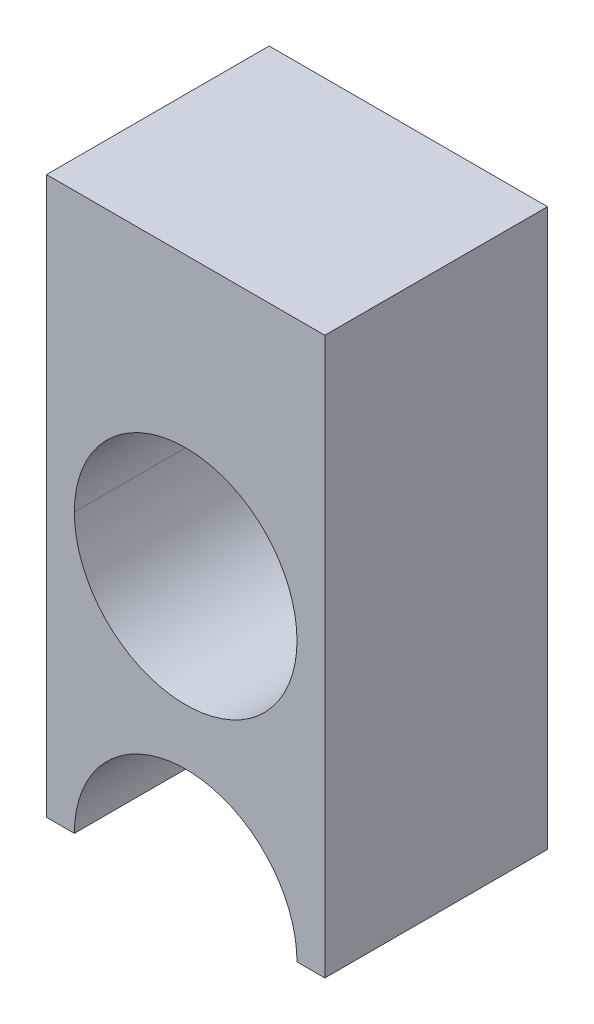
ISO-10303-21;
HEADER;
FILE_DESCRIPTION(('STEP AP214'),'2;1');
FILE_NAME('part.step','',(''),(''),'','','');
FILE_SCHEMA(('AUTOMOTIVE_DESIGN { 1 0 10303 214 1 1 1 1 }'));
ENDSEC;
DATA;
#1=APPLICATION_CONTEXT('core data for automotive mechanical design processes');
#2=APPLICATION_PROTOCOL_DEFINITION('international standard','automotive_design',2000,#1);
#3=PRODUCT_CONTEXT('',#1,'mechanical');
#4=PRODUCT('Part','Part','',(#3));
#5=PRODUCT_RELATED_PRODUCT_CATEGORY('part','',(#4));
#6=PRODUCT_DEFINITION_FORMATION('','',#4);
#7=PRODUCT_DEFINITION_CONTEXT('part definition',#1,'design');
#8=PRODUCT_DEFINITION('design','',#6,#7);
#9=PRODUCT_DEFINITION_SHAPE('','',#8);
#10=(LENGTH_UNIT() NAMED_UNIT(*) SI_UNIT(.MILLI.,.METRE.));
#11=(NAMED_UNIT(*) PLANE_ANGLE_UNIT() SI_UNIT($,.RADIAN.));
#12=(NAMED_UNIT(*) SI_UNIT($,.STERADIAN.) SOLID_ANGLE_UNIT());
#13=UNCERTAINTY_MEASURE_WITH_UNIT(LENGTH_MEASURE(1.E-05),#10,'distance_accuracy_value','');
#14=(GEOMETRIC_REPRESENTATION_CONTEXT(3) GLOBAL_UNCERTAINTY_ASSIGNED_CONTEXT((#13)) GLOBAL_UNIT_ASSIGNED_CONTEXT((#10,
#11,#12)) REPRESENTATION_CONTEXT('',''));
#15=CARTESIAN_POINT('',(0.,0.,0.));
#16=DIRECTION('',(0.,0.,1.));
#17=DIRECTION('',(1.,0.,0.));
#18=AXIS2_PLACEMENT_3D('',#15,#16,#17);
#19=CARTESIAN_POINT('',(0.,1.,0.));
#20=DIRECTION('',(0.,0.,1.));
#21=DIRECTION('',(1.,0.,0.));
#22=AXIS2_PLACEMENT_3D('',#19,#20,#21);
#23=CYLINDRICAL_SURFACE('',#22,0.4);
#24=DIRECTION('',(0.,0.,1.));
#25=VECTOR('',#24,1.);
#26=CARTESIAN_POINT('',(-0.4,1.,0.));
#27=LINE('',#26,#25);
#28=CARTESIAN_POINT('',(-0.4,1.,-0.4));
#29=VERTEX_POINT('',#28);
#30=CARTESIAN_POINT('',(-0.4,1.,0.4));
#31=VERTEX_POINT('',#30);
#32=EDGE_CURVE('E131',#29,#31,#27,.T.);
#33=ORIENTED_EDGE('',*,*,#32,.F.);
#34=CARTESIAN_POINT('',(0.,1.,-0.4));
#35=DIRECTION('',(0.,0.,-1.));
#36=DIRECTION('',(1.,0.,0.));
#37=AXIS2_PLACEMENT_3D('',#34,#35,#36);
#38=CIRCLE('',#37,0.4);
#39=CARTESIAN_POINT('',(0.4,1.,-0.4));
#40=VERTEX_POINT('',#39);
#41=EDGE_CURVE('E174',#29,#40,#38,.T.);
#42=ORIENTED_EDGE('',*,*,#41,.T.);
#43=DIRECTION('',(0.,0.,1.));
#44=VECTOR('',#43,1.);
#45=CARTESIAN_POINT('',(0.4,1.,0.));
#46=LINE('',#45,#44);
#47=CARTESIAN_POINT('',(0.4,1.,0.4));
#48=VERTEX_POINT('',#47);
#49=EDGE_CURVE('E137',#40,#48,#46,.T.);
#50=ORIENTED_EDGE('',*,*,#49,.T.);
#51=CARTESIAN_POINT('',(0.,1.,0.4));
#52=DIRECTION('',(0.,0.,-1.));
#53=DIRECTION('',(1.,0.,0.));
#54=AXIS2_PLACEMENT_3D('',#51,#52,#53);
#55=CIRCLE('',#54,0.4);
#56=EDGE_CURVE('E121',#31,#48,#55,.T.);
#57=ORIENTED_EDGE('',*,*,#56,.F.);
#58=EDGE_LOOP('',(#33,#42,#50,#57));
#59=FACE_BOUND('',#58,.T.);
#60=ADVANCED_FACE('F17',(#59),#23,.F.);
#61=CARTESIAN_POINT('',(0.4,0.,0.));
#62=DIRECTION('',(0.,-1.,0.));
#63=DIRECTION('',(0.,0.,-1.));
#64=AXIS2_PLACEMENT_3D('',#61,#62,#63);
#65=PLANE('',#64);
#66=DIRECTION('',(0.,0.,-1.));
#67=VECTOR('',#66,1.);
#68=CARTESIAN_POINT('',(0.5,0.,0.));
#69=LINE('',#68,#67);
#70=CARTESIAN_POINT('',(0.5,0.,0.4));
#71=VERTEX_POINT('',#70);
#72=CARTESIAN_POINT('',(0.5,0.,-0.4));
#73=VERTEX_POINT('',#72);
#74=EDGE_CURVE('E11',#71,#73,#69,.T.);
#75=ORIENTED_EDGE('',*,*,#74,.F.);
#76=DIRECTION('',(1.,0.,0.));
#77=VECTOR('',#76,1.);
#78=CARTESIAN_POINT('',(0.,0.,0.4));
#79=LINE('',#78,#77);
#80=CARTESIAN_POINT('',(0.4,0.,0.4));
#81=VERTEX_POINT('',#80);
#82=EDGE_CURVE('E153',#81,#71,#79,.T.);
#83=ORIENTED_EDGE('',*,*,#82,.F.);
#84=DIRECTION('',(0.,0.,-1.));
#85=VECTOR('',#84,1.);
#86=CARTESIAN_POINT('',(0.4,0.,0.));
#87=LINE('',#86,#85);
#88=CARTESIAN_POINT('',(0.4,0.,-0.4));
#89=VERTEX_POINT('',#88);
#90=EDGE_CURVE('E26',#81,#89,#87,.T.);
#91=ORIENTED_EDGE('',*,*,#90,.T.);
#92=DIRECTION('',(1.,0.,0.));
#93=VECTOR('',#92,1.);
#94=CARTESIAN_POINT('',(0.,0.,-0.4));
#95=LINE('',#94,#93);
#96=EDGE_CURVE('E101',#89,#73,#95,.T.);
#97=ORIENTED_EDGE('',*,*,#96,.T.);
#98=EDGE_LOOP('',(#75,#83,#91,#97));
#99=FACE_BOUND('',#98,.T.);
#100=ADVANCED_FACE('F184',(#99),#65,.T.);
#101=CARTESIAN_POINT('',(0.5,0.,0.));
#102=DIRECTION('',(1.,0.,0.));
#103=DIRECTION('',(0.,1.,0.));
#104=AXIS2_PLACEMENT_3D('',#101,#102,#103);
#105=PLANE('',#104);
#106=DIRECTION('',(0.,0.,-1.));
#107=VECTOR('',#106,1.);
#108=CARTESIAN_POINT('',(0.5,2.,0.));
#109=LINE('',#108,#107);
#110=CARTESIAN_POINT('',(0.5,2.,0.4));
#111=VERTEX_POINT('',#110);
#112=CARTESIAN_POINT('',(0.5,2.,-0.4));
#113=VERTEX_POINT('',#112);
#114=EDGE_CURVE('E38',#111,#113,#109,.T.);
#115=ORIENTED_EDGE('',*,*,#114,.F.);
#116=DIRECTION('',(0.,1.,0.));
#117=VECTOR('',#116,1.);
#118=CARTESIAN_POINT('',(0.5,1.015877012191,0.4));
#119=LINE('',#118,#117);
#120=EDGE_CURVE('E158',#71,#111,#119,.T.);
#121=ORIENTED_EDGE('',*,*,#120,.F.);
#122=ORIENTED_EDGE('',*,*,#74,.T.);
#123=DIRECTION('',(0.,1.,0.));
#124=VECTOR('',#123,1.);
#125=CARTESIAN_POINT('',(0.5,1.015877012191,-0.4));
#126=LINE('',#125,#124);
#127=EDGE_CURVE('E168',#73,#113,#126,.T.);
#128=ORIENTED_EDGE('',*,*,#127,.T.);
#129=EDGE_LOOP('',(#115,#121,#122,#128));
#130=FACE_BOUND('',#129,.T.);
#131=ADVANCED_FACE('F230',(#130),#105,.T.);
#132=CARTESIAN_POINT('',(0.,0.,0.));
#133=DIRECTION('',(0.,0.,1.));
#134=DIRECTION('',(1.,0.,0.));
#135=AXIS2_PLACEMENT_3D('',#132,#133,#134);
#136=CYLINDRICAL_SURFACE('',#135,0.4);
#137=DIRECTION('',(0.,0.,1.));
#138=VECTOR('',#137,1.);
#139=CARTESIAN_POINT('',(-0.4,0.,0.));
#140=LINE('',#139,#138);
#141=CARTESIAN_POINT('',(-0.4,0.,-0.4));
#142=VERTEX_POINT('',#141);
#143=CARTESIAN_POINT('',(-0.4,0.,0.4));
#144=VERTEX_POINT('',#143);
#145=EDGE_CURVE('E110',#142,#144,#140,.T.);
#146=ORIENTED_EDGE('',*,*,#145,.F.);
#147=CARTESIAN_POINT('',(0.,0.,-0.4));
#148=DIRECTION('',(0.,0.,-1.));
#149=DIRECTION('',(1.,0.,0.));
#150=AXIS2_PLACEMENT_3D('',#147,#148,#149);
#151=CIRCLE('',#150,0.4);
#152=EDGE_CURVE('E93',#142,#89,#151,.T.);
#153=ORIENTED_EDGE('',*,*,#152,.T.);
#154=ORIENTED_EDGE('',*,*,#90,.F.);
#155=CARTESIAN_POINT('',(0.,0.,0.4));
#156=DIRECTION('',(0.,0.,-1.));
#157=DIRECTION('',(1.,0.,0.));
#158=AXIS2_PLACEMENT_3D('',#155,#156,#157);
#159=CIRCLE('',#158,0.4);
#160=EDGE_CURVE('E118',#144,#81,#159,.T.);
#161=ORIENTED_EDGE('',*,*,#160,.F.);
#162=EDGE_LOOP('',(#146,#153,#154,#161));
#163=FACE_BOUND('',#162,.T.);
#164=ADVANCED_FACE('F116',(#163),#136,.F.);
#165=CARTESIAN_POINT('',(0.5,2.,0.));
#166=DIRECTION('',(0.,1.,0.));
#167=DIRECTION('',(1.,0.,0.));
#168=AXIS2_PLACEMENT_3D('',#165,#166,#167);
#169=PLANE('',#168);
#170=DIRECTION('',(0.,0.,-1.));
#171=VECTOR('',#170,1.);
#172=CARTESIAN_POINT('',(-0.5,2.,0.));
#173=LINE('',#172,#171);
#174=CARTESIAN_POINT('',(-0.5,2.,0.4));
#175=VERTEX_POINT('',#174);
#176=CARTESIAN_POINT('',(-0.5,2.,-0.4));
#177=VERTEX_POINT('',#176);
#178=EDGE_CURVE('E147',#175,#177,#173,.T.);
#179=ORIENTED_EDGE('',*,*,#178,.F.);
#180=DIRECTION('',(-1.,0.,0.));
#181=VECTOR('',#180,1.);
#182=CARTESIAN_POINT('',(0.,2.,0.4));
#183=LINE('',#182,#181);
#184=EDGE_CURVE('E127',#111,#175,#183,.T.);
#185=ORIENTED_EDGE('',*,*,#184,.F.);
#186=ORIENTED_EDGE('',*,*,#114,.T.);
#187=DIRECTION('',(-1.,0.,0.));
#188=VECTOR('',#187,1.);
#189=CARTESIAN_POINT('',(0.,2.,-0.4));
#190=LINE('',#189,#188);
#191=EDGE_CURVE('E105',#113,#177,#190,.T.);
#192=ORIENTED_EDGE('',*,*,#191,.T.);
#193=EDGE_LOOP('',(#179,#185,#186,#192));
#194=FACE_BOUND('',#193,.T.);
#195=ADVANCED_FACE('F238',(#194),#169,.T.);
#196=CARTESIAN_POINT('',(0.,1.015877012191,-0.4));
#197=DIRECTION('',(0.,0.,1.));
#198=DIRECTION('',(1.,0.,0.));
#199=AXIS2_PLACEMENT_3D('',#196,#197,#198);
#200=PLANE('',#199);
#201=CARTESIAN_POINT('',(0.,1.,-0.4));
#202=DIRECTION('',(0.,0.,-1.));
#203=DIRECTION('',(1.,0.,0.));
#204=AXIS2_PLACEMENT_3D('',#201,#202,#203);
#205=CIRCLE('',#204,0.4);
#206=EDGE_CURVE('E197',#40,#29,#205,.T.);
#207=ORIENTED_EDGE('',*,*,#206,.F.);
#208=ORIENTED_EDGE('',*,*,#41,.F.);
#209=EDGE_LOOP('',(#207,#208));
#210=FACE_BOUND('',#209,.T.);
#211=ORIENTED_EDGE('',*,*,#96,.F.);
#212=ORIENTED_EDGE('',*,*,#152,.F.);
#213=DIRECTION('',(1.,0.,0.));
#214=VECTOR('',#213,1.);
#215=CARTESIAN_POINT('',(-0.5,0.,-0.4));
#216=LINE('',#215,#214);
#217=CARTESIAN_POINT('',(-0.5,0.,-0.4));
#218=VERTEX_POINT('',#217);
#219=EDGE_CURVE('E97',#218,#142,#216,.T.);
#220=ORIENTED_EDGE('',*,*,#219,.F.);
#221=DIRECTION('',(0.,-1.,0.));
#222=VECTOR('',#221,1.);
#223=CARTESIAN_POINT('',(-0.5,2.,-0.4));
#224=LINE('',#223,#222);
#225=EDGE_CURVE('E151',#177,#218,#224,.T.);
#226=ORIENTED_EDGE('',*,*,#225,.F.);
#227=ORIENTED_EDGE('',*,*,#191,.F.);
#228=ORIENTED_EDGE('',*,*,#127,.F.);
#229=EDGE_LOOP('',(#211,#212,#220,#226,#227,#228));
#230=FACE_BOUND('',#229,.T.);
#231=ADVANCED_FACE('F95',(#210,#230),#200,.F.);
#232=CARTESIAN_POINT('',(-0.5,0.,0.));
#233=DIRECTION('',(0.,-1.,0.));
#234=DIRECTION('',(0.,0.,-1.));
#235=AXIS2_PLACEMENT_3D('',#232,#233,#234);
#236=PLANE('',#235);
#237=ORIENTED_EDGE('',*,*,#145,.T.);
#238=DIRECTION('',(1.,0.,0.));
#239=VECTOR('',#238,1.);
#240=CARTESIAN_POINT('',(0.,0.,0.4));
#241=LINE('',#240,#239);
#242=CARTESIAN_POINT('',(-0.5,0.,0.4));
#243=VERTEX_POINT('',#242);
#244=EDGE_CURVE('E154',#243,#144,#241,.T.);
#245=ORIENTED_EDGE('',*,*,#244,.F.);
#246=DIRECTION('',(0.,0.,1.));
#247=VECTOR('',#246,1.);
#248=CARTESIAN_POINT('',(-0.5,0.,0.));
#249=LINE('',#248,#247);
#250=EDGE_CURVE('E113',#218,#243,#249,.T.);
#251=ORIENTED_EDGE('',*,*,#250,.F.);
#252=ORIENTED_EDGE('',*,*,#219,.T.);
#253=EDGE_LOOP('',(#237,#245,#251,#252));
#254=FACE_BOUND('',#253,.T.);
#255=ADVANCED_FACE('F109',(#254),#236,.T.);
#256=CARTESIAN_POINT('',(0.,1.015877012191,0.4));
#257=DIRECTION('',(0.,0.,1.));
#258=DIRECTION('',(1.,0.,0.));
#259=AXIS2_PLACEMENT_3D('',#256,#257,#258);
#260=PLANE('',#259);
#261=CARTESIAN_POINT('',(0.,1.,0.4));
#262=DIRECTION('',(0.,0.,-1.));
#263=DIRECTION('',(1.,0.,0.));
#264=AXIS2_PLACEMENT_3D('',#261,#262,#263);
#265=CIRCLE('',#264,0.4);
#266=EDGE_CURVE('E133',#48,#31,#265,.T.);
#267=ORIENTED_EDGE('',*,*,#266,.T.);
#268=ORIENTED_EDGE('',*,*,#56,.T.);
#269=EDGE_LOOP('',(#267,#268));
#270=FACE_BOUND('',#269,.T.);
#271=ORIENTED_EDGE('',*,*,#244,.T.);
#272=ORIENTED_EDGE('',*,*,#160,.T.);
#273=ORIENTED_EDGE('',*,*,#82,.T.);
#274=ORIENTED_EDGE('',*,*,#120,.T.);
#275=ORIENTED_EDGE('',*,*,#184,.T.);
#276=DIRECTION('',(0.,1.,0.));
#277=VECTOR('',#276,1.);
#278=CARTESIAN_POINT('',(-0.5,2.,0.4));
#279=LINE('',#278,#277);
#280=EDGE_CURVE('E143',#243,#175,#279,.T.);
#281=ORIENTED_EDGE('',*,*,#280,.F.);
#282=EDGE_LOOP('',(#271,#272,#273,#274,#275,#281));
#283=FACE_BOUND('',#282,.T.);
#284=ADVANCED_FACE('F187',(#270,#283),#260,.T.);
#285=CARTESIAN_POINT('',(-0.5,2.,0.));
#286=DIRECTION('',(-1.,0.,0.));
#287=DIRECTION('',(0.,1.,0.));
#288=AXIS2_PLACEMENT_3D('',#285,#286,#287);
#289=PLANE('',#288);
#290=ORIENTED_EDGE('',*,*,#250,.T.);
#291=ORIENTED_EDGE('',*,*,#280,.T.);
#292=ORIENTED_EDGE('',*,*,#178,.T.);
#293=ORIENTED_EDGE('',*,*,#225,.T.);
#294=EDGE_LOOP('',(#290,#291,#292,#293));
#295=FACE_BOUND('',#294,.T.);
#296=ADVANCED_FACE('F191',(#295),#289,.T.);
#297=CARTESIAN_POINT('',(0.,1.,0.));
#298=DIRECTION('',(0.,0.,1.));
#299=DIRECTION('',(1.,0.,0.));
#300=AXIS2_PLACEMENT_3D('',#297,#298,#299);
#301=CYLINDRICAL_SURFACE('',#300,0.4);
#302=ORIENTED_EDGE('',*,*,#206,.T.);
#303=ORIENTED_EDGE('',*,*,#32,.T.);
#304=ORIENTED_EDGE('',*,*,#266,.F.);
#305=ORIENTED_EDGE('',*,*,#49,.F.);
#306=EDGE_LOOP('',(#302,#303,#304,#305));
#307=FACE_BOUND('',#306,.T.);
#308=ADVANCED_FACE('F211',(#307),#301,.F.);
#309=CLOSED_SHELL('',(#60,#100,#131,#164,#195,#231,#255,#284,#296,#308));
#310=MANIFOLD_SOLID_BREP('B1',#309);
#311=ADVANCED_BREP_SHAPE_REPRESENTATION('',(#18,#310),#14);
#312=SHAPE_DEFINITION_REPRESENTATION(#9,#311);
ENDSEC;
END-ISO-10303-21;
